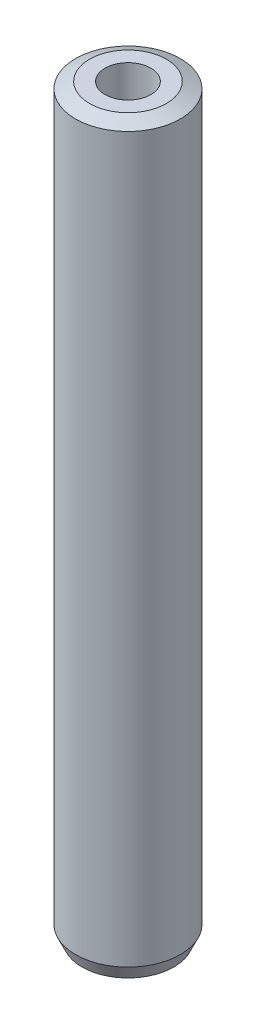
ISO-10303-21;
HEADER;
FILE_DESCRIPTION(('STEP AP214'),'2;1');
FILE_NAME('part.step','',(''),(''),'','','');
FILE_SCHEMA(('AUTOMOTIVE_DESIGN { 1 0 10303 214 1 1 1 1 }'));
ENDSEC;
DATA;
#1=APPLICATION_CONTEXT('core data for automotive mechanical design processes');
#2=APPLICATION_PROTOCOL_DEFINITION('international standard','automotive_design',2000,#1);
#3=PRODUCT_CONTEXT('',#1,'mechanical');
#4=PRODUCT('Part','Part','',(#3));
#5=PRODUCT_RELATED_PRODUCT_CATEGORY('part','',(#4));
#6=PRODUCT_DEFINITION_FORMATION('','',#4);
#7=PRODUCT_DEFINITION_CONTEXT('part definition',#1,'design');
#8=PRODUCT_DEFINITION('design','',#6,#7);
#9=PRODUCT_DEFINITION_SHAPE('','',#8);
#10=(LENGTH_UNIT() NAMED_UNIT(*) SI_UNIT(.MILLI.,.METRE.));
#11=(NAMED_UNIT(*) PLANE_ANGLE_UNIT() SI_UNIT($,.RADIAN.));
#12=(NAMED_UNIT(*) SI_UNIT($,.STERADIAN.) SOLID_ANGLE_UNIT());
#13=UNCERTAINTY_MEASURE_WITH_UNIT(LENGTH_MEASURE(1.E-05),#10,'distance_accuracy_value','');
#14=(GEOMETRIC_REPRESENTATION_CONTEXT(3) GLOBAL_UNCERTAINTY_ASSIGNED_CONTEXT((#13)) GLOBAL_UNIT_ASSIGNED_CONTEXT((#10,
#11,#12)) REPRESENTATION_CONTEXT('',''));
#15=CARTESIAN_POINT('',(0.,0.,0.));
#16=DIRECTION('',(0.,0.,1.));
#17=DIRECTION('',(1.,0.,0.));
#18=AXIS2_PLACEMENT_3D('',#15,#16,#17);
#19=CARTESIAN_POINT('',(0.,568.272869742962,0.));
#20=DIRECTION('',(0.,-1.,0.));
#21=DIRECTION('',(0.,0.,-1.));
#22=AXIS2_PLACEMENT_3D('',#19,#20,#21);
#23=CYLINDRICAL_SURFACE('',#22,40.);
#24=CARTESIAN_POINT('',(0.,563.381055566495,0.));
#25=DIRECTION('',(0.,1.,0.));
#26=DIRECTION('',(0.,0.,1.));
#27=AXIS2_PLACEMENT_3D('',#24,#25,#26);
#28=CIRCLE('',#27,40.);
#29=CARTESIAN_POINT('',(0.,563.381055566495,40.));
#30=VERTEX_POINT('',#29);
#31=EDGE_CURVE('E50',#30,#30,#28,.F.);
#32=ORIENTED_EDGE('',*,*,#31,.T.);
#33=EDGE_LOOP('',(#32));
#34=FACE_BOUND('',#33,.T.);
#35=CARTESIAN_POINT('',(0.,10.6560334741437,0.));
#36=DIRECTION('',(0.,1.,0.));
#37=DIRECTION('',(0.,0.,1.));
#38=AXIS2_PLACEMENT_3D('',#35,#36,#37);
#39=CIRCLE('',#38,40.);
#40=CARTESIAN_POINT('',(0.,10.6560334741437,40.));
#41=VERTEX_POINT('',#40);
#42=EDGE_CURVE('E51',#41,#41,#39,.T.);
#43=ORIENTED_EDGE('',*,*,#42,.T.);
#44=EDGE_LOOP('',(#43));
#45=FACE_BOUND('',#44,.T.);
#46=ADVANCED_FACE('F39',(#34,#45),#23,.T.);
#47=CARTESIAN_POINT('',(0.,568.272869742962,0.));
#48=DIRECTION('',(0.,1.,0.));
#49=DIRECTION('',(0.,0.,1.));
#50=AXIS2_PLACEMENT_3D('',#47,#48,#49);
#51=PLANE('',#50);
#52=CARTESIAN_POINT('',(0.,568.272869742962,0.));
#53=DIRECTION('',(0.,1.,0.));
#54=DIRECTION('',(0.,0.,1.));
#55=AXIS2_PLACEMENT_3D('',#52,#53,#54);
#56=CIRCLE('',#55,29.3439665258561);
#57=CARTESIAN_POINT('',(0.,568.272869742962,29.3439665258561));
#58=VERTEX_POINT('',#57);
#59=EDGE_CURVE('E54',#58,#58,#56,.T.);
#60=ORIENTED_EDGE('',*,*,#59,.T.);
#61=EDGE_LOOP('',(#60));
#62=FACE_BOUND('',#61,.T.);
#63=CARTESIAN_POINT('',(0.,568.272869742962,0.));
#64=DIRECTION('',(0.,1.,0.));
#65=DIRECTION('',(0.,0.,1.));
#66=AXIS2_PLACEMENT_3D('',#63,#64,#65);
#67=CIRCLE('',#66,17.5089397413084);
#68=CARTESIAN_POINT('',(0.,568.272869742962,17.5089397413084));
#69=VERTEX_POINT('',#68);
#70=EDGE_CURVE('E58',#69,#69,#67,.T.);
#71=ORIENTED_EDGE('',*,*,#70,.F.);
#72=EDGE_LOOP('',(#71));
#73=FACE_BOUND('',#72,.T.);
#74=ADVANCED_FACE('F69',(#62,#73),#51,.T.);
#75=CARTESIAN_POINT('',(0.,0.,0.));
#76=DIRECTION('',(0.,1.,0.));
#77=DIRECTION('',(0.,0.,1.));
#78=AXIS2_PLACEMENT_3D('',#75,#76,#77);
#79=PLANE('',#78);
#80=CARTESIAN_POINT('',(0.,0.,0.));
#81=DIRECTION('',(0.,1.,0.));
#82=DIRECTION('',(0.,0.,1.));
#83=AXIS2_PLACEMENT_3D('',#80,#81,#82);
#84=CIRCLE('',#83,35.1081858235326);
#85=CARTESIAN_POINT('',(0.,0.,35.1081858235326));
#86=VERTEX_POINT('',#85);
#87=EDGE_CURVE('E10',#86,#86,#84,.F.);
#88=ORIENTED_EDGE('',*,*,#87,.T.);
#89=EDGE_LOOP('',(#88));
#90=FACE_BOUND('',#89,.T.);
#91=CARTESIAN_POINT('',(0.,0.,0.));
#92=DIRECTION('',(0.,1.,0.));
#93=DIRECTION('',(0.,0.,1.));
#94=AXIS2_PLACEMENT_3D('',#91,#92,#93);
#95=CIRCLE('',#94,17.5089397413084);
#96=CARTESIAN_POINT('',(0.,0.,17.5089397413084));
#97=VERTEX_POINT('',#96);
#98=EDGE_CURVE('E63',#97,#97,#95,.T.);
#99=ORIENTED_EDGE('',*,*,#98,.T.);
#100=EDGE_LOOP('',(#99));
#101=FACE_BOUND('',#100,.T.);
#102=ADVANCED_FACE('F75',(#90,#101),#79,.F.);
#103=CARTESIAN_POINT('',(0.,568.272869742962,0.));
#104=DIRECTION('',(0.,-1.,0.));
#105=DIRECTION('',(0.,0.,-1.));
#106=AXIS2_PLACEMENT_3D('',#103,#104,#105);
#107=CYLINDRICAL_SURFACE('',#106,17.5089397413084);
#108=ORIENTED_EDGE('',*,*,#70,.T.);
#109=EDGE_LOOP('',(#108));
#110=FACE_BOUND('',#109,.T.);
#111=ORIENTED_EDGE('',*,*,#98,.F.);
#112=EDGE_LOOP('',(#111));
#113=FACE_BOUND('',#112,.T.);
#114=ADVANCED_FACE('F70',(#110,#113),#107,.F.);
#115=CARTESIAN_POINT('',(0.,568.272869742962,0.));
#116=DIRECTION('',(0.,-1.,0.));
#117=DIRECTION('',(0.,0.,-1.));
#118=AXIS2_PLACEMENT_3D('',#115,#116,#117);
#119=CONICAL_SURFACE('',#118,29.3439665258561,1.14042939862986);
#120=ORIENTED_EDGE('',*,*,#31,.F.);
#121=EDGE_LOOP('',(#120));
#122=FACE_BOUND('',#121,.T.);
#123=ORIENTED_EDGE('',*,*,#59,.F.);
#124=EDGE_LOOP('',(#123));
#125=FACE_BOUND('',#124,.T.);
#126=ADVANCED_FACE('F81',(#122,#125),#119,.T.);
#127=CARTESIAN_POINT('',(0.,10.6560334741437,0.));
#128=DIRECTION('',(0.,1.,0.));
#129=DIRECTION('',(0.,0.,1.));
#130=AXIS2_PLACEMENT_3D('',#127,#128,#129);
#131=CONICAL_SURFACE('',#130,40.,0.430366928165039);
#132=ORIENTED_EDGE('',*,*,#87,.F.);
#133=EDGE_LOOP('',(#132));
#134=FACE_BOUND('',#133,.T.);
#135=ORIENTED_EDGE('',*,*,#42,.F.);
#136=EDGE_LOOP('',(#135));
#137=FACE_BOUND('',#136,.T.);
#138=ADVANCED_FACE('F45',(#134,#137),#131,.T.);
#139=CLOSED_SHELL('',(#46,#74,#102,#114,#126,#138));
#140=MANIFOLD_SOLID_BREP('B2',#139);
#141=ADVANCED_BREP_SHAPE_REPRESENTATION('',(#18,#140),#14);
#142=SHAPE_DEFINITION_REPRESENTATION(#9,#141);
ENDSEC;
END-ISO-10303-21;
